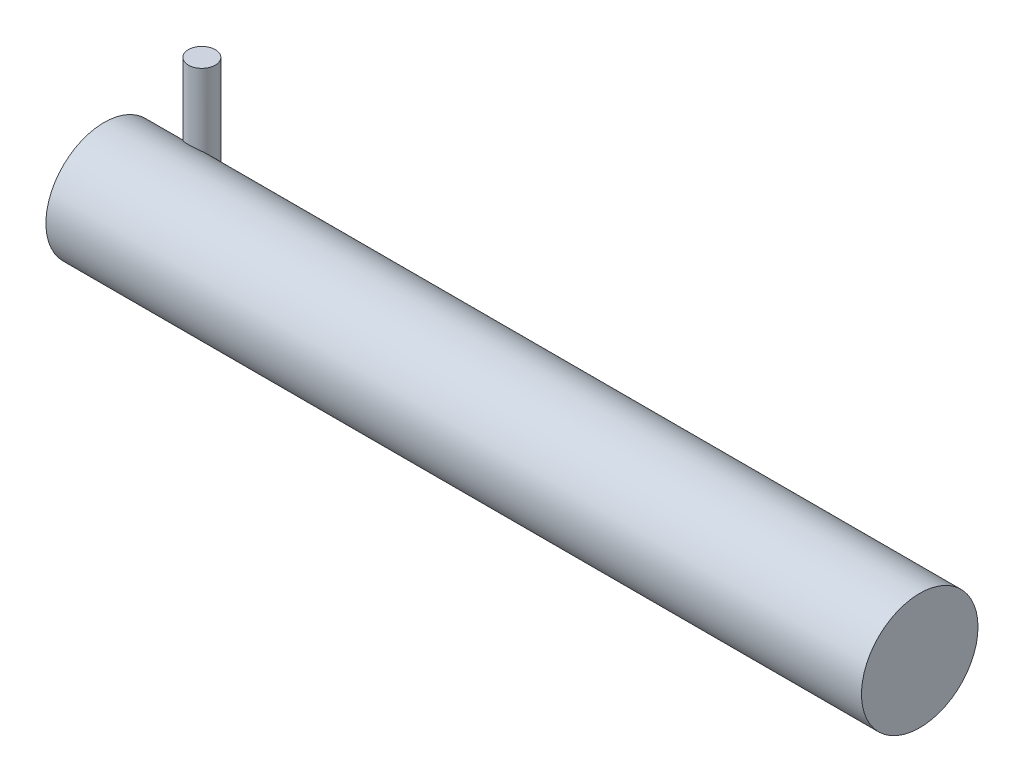
ISO-10303-21;
HEADER;
FILE_DESCRIPTION(('STEP AP214'),'2;1');
FILE_NAME('part.step','',(''),(''),'','','');
FILE_SCHEMA(('AUTOMOTIVE_DESIGN { 1 0 10303 214 1 1 1 1 }'));
ENDSEC;
DATA;
#1=APPLICATION_CONTEXT('core data for automotive mechanical design processes');
#2=APPLICATION_PROTOCOL_DEFINITION('international standard','automotive_design',2000,#1);
#3=PRODUCT_CONTEXT('',#1,'mechanical');
#4=PRODUCT('Part','Part','',(#3));
#5=PRODUCT_RELATED_PRODUCT_CATEGORY('part','',(#4));
#6=PRODUCT_DEFINITION_FORMATION('','',#4);
#7=PRODUCT_DEFINITION_CONTEXT('part definition',#1,'design');
#8=PRODUCT_DEFINITION('design','',#6,#7);
#9=PRODUCT_DEFINITION_SHAPE('','',#8);
#10=(LENGTH_UNIT() NAMED_UNIT(*) SI_UNIT(.MILLI.,.METRE.));
#11=(NAMED_UNIT(*) PLANE_ANGLE_UNIT() SI_UNIT($,.RADIAN.));
#12=(NAMED_UNIT(*) SI_UNIT($,.STERADIAN.) SOLID_ANGLE_UNIT());
#13=UNCERTAINTY_MEASURE_WITH_UNIT(LENGTH_MEASURE(1.E-05),#10,'distance_accuracy_value','');
#14=(GEOMETRIC_REPRESENTATION_CONTEXT(3) GLOBAL_UNCERTAINTY_ASSIGNED_CONTEXT((#13)) GLOBAL_UNIT_ASSIGNED_CONTEXT((#10,
#11,#12)) REPRESENTATION_CONTEXT('',''));
#15=CARTESIAN_POINT('',(0.,0.,0.));
#16=DIRECTION('',(0.,0.,1.));
#17=DIRECTION('',(1.,0.,0.));
#18=AXIS2_PLACEMENT_3D('',#15,#16,#17);
#19=CARTESIAN_POINT('',(70.,0.,0.));
#20=DIRECTION('',(-1.,0.,0.));
#21=DIRECTION('',(0.,0.,1.));
#22=AXIS2_PLACEMENT_3D('',#19,#20,#21);
#23=CYLINDRICAL_SURFACE('',#22,5.);
#24=CARTESIAN_POINT('',(0.,0.,0.));
#25=DIRECTION('',(1.,0.,0.));
#26=DIRECTION('',(0.,0.,-1.));
#27=AXIS2_PLACEMENT_3D('',#24,#25,#26);
#28=CIRCLE('',#27,5.);
#29=CARTESIAN_POINT('',(0.,0.,-5.));
#30=VERTEX_POINT('',#29);
#31=EDGE_CURVE('E69',#30,#30,#28,.T.);
#32=ORIENTED_EDGE('',*,*,#31,.T.);
#33=EDGE_LOOP('',(#32));
#34=FACE_BOUND('',#33,.T.);
#35=CARTESIAN_POINT('',(70.,0.,0.));
#36=DIRECTION('',(1.,0.,0.));
#37=DIRECTION('',(0.,0.,-1.));
#38=AXIS2_PLACEMENT_3D('',#35,#36,#37);
#39=CIRCLE('',#38,5.);
#40=CARTESIAN_POINT('',(70.,0.,-5.));
#41=VERTEX_POINT('',#40);
#42=EDGE_CURVE('E64',#41,#41,#39,.T.);
#43=ORIENTED_EDGE('',*,*,#42,.F.);
#44=EDGE_LOOP('',(#43));
#45=FACE_BOUND('',#44,.T.);
#46=CARTESIAN_POINT('',(3.7403080723953,0.,-5.));
#47=CARTESIAN_POINT('',(3.74031654285205,0.0412414710687475,-5.00000071223977));
#48=CARTESIAN_POINT('',(3.73950383783599,0.0824765192694198,-4.99948965406981));
#49=CARTESIAN_POINT('',(3.73630834279093,0.164847938448094,-4.99745140875703));
#50=CARTESIAN_POINT('',(3.73392605044858,0.205984336557935,-4.99592454370598));
#51=CARTESIAN_POINT('',(3.7245511332552,0.328909386408874,-4.98984306647468));
#52=CARTESIAN_POINT('',(3.71532962729995,0.41046252468489,-4.9837874712133));
#53=CARTESIAN_POINT('',(3.69213595043174,0.572482721014253,-4.96778620573457));
#54=CARTESIAN_POINT('',(3.6781627784587,0.652949546490931,-4.95783971573419));
#55=CARTESIAN_POINT('',(3.64687899798341,0.812725072650039,-4.93416705303572));
#56=CARTESIAN_POINT('',(3.62956534380931,0.892032644854037,-4.92043742614836));
#57=CARTESIAN_POINT('',(3.57866350356115,1.11084778739966,-4.87713392715142));
#58=CARTESIAN_POINT('',(3.54291411676771,1.24906473029694,-4.84355428893073));
#59=CARTESIAN_POINT('',(3.47093924772518,1.52209651691205,-4.76481005371624));
#60=CARTESIAN_POINT('',(3.43471346921181,1.65690907496686,-4.71963788945655));
#61=CARTESIAN_POINT('',(3.36631815198417,1.92277459788118,-4.61769925657684));
#62=CARTESIAN_POINT('',(3.33413855685096,2.05383623225245,-4.56096249009628));
#63=CARTESIAN_POINT('',(3.27789706996648,2.31190193480728,-4.43572191925716));
#64=CARTESIAN_POINT('',(3.25382361327305,2.43891154759426,-4.36723509112497));
#65=CARTESIAN_POINT('',(3.22178043367329,2.66424122207382,-4.23268314470644));
#66=CARTESIAN_POINT('',(3.21162187113142,2.76343235412826,-4.16862411724844));
#67=CARTESIAN_POINT('',(3.20273467599719,2.9575468648251,-4.0332291367525));
#68=CARTESIAN_POINT('',(3.20402006862161,3.05246486334907,-3.96188436044508));
#69=CARTESIAN_POINT('',(3.22203613728855,3.23749459528526,-3.81220143833861));
#70=CARTESIAN_POINT('',(3.23896615658192,3.32752838519286,-3.73378484594354));
#71=CARTESIAN_POINT('',(3.27961887329985,3.45560785519916,-3.61416858062181));
#72=CARTESIAN_POINT('',(3.29568598698955,3.49709617847598,-3.5740110978478));
#73=CARTESIAN_POINT('',(3.33349104776429,3.57735155538919,-3.49367517703475));
#74=CARTESIAN_POINT('',(3.35522442812107,3.61612076870605,-3.45349678175702));
#75=CARTESIAN_POINT('',(3.40940055373551,3.69714677035682,-3.36678267349509));
#76=CARTESIAN_POINT('',(3.44306731346298,3.73877341720701,-3.32040580387941));
#77=CARTESIAN_POINT('',(3.51967772870629,3.81653311065159,-3.23072717217243));
#78=CARTESIAN_POINT('',(3.56261945269806,3.85266729839281,-3.18742477230958));
#79=CARTESIAN_POINT('',(3.65825336589082,3.91869348688536,-3.10590120491951));
#80=CARTESIAN_POINT('',(3.71103335896656,3.94852366172994,-3.0677315901536));
#81=CARTESIAN_POINT('',(3.82513287639818,4.00042725526388,-2.99973734603108));
#82=CARTESIAN_POINT('',(3.88644390714371,4.02250831299154,-2.96990450427329));
#83=CARTESIAN_POINT('',(4.00645799138492,4.05558726543488,-2.92453254770686));
#84=CARTESIAN_POINT('',(4.0643166848589,4.06770662098706,-2.9075738756989));
#85=CARTESIAN_POINT('',(4.18293935962775,4.08526164952594,-2.88285861306663));
#86=CARTESIAN_POINT('',(4.24370131018533,4.09070192522767,-2.87509568556274));
#87=CARTESIAN_POINT('',(4.35912541293167,4.0945259460452,-2.86964503598543));
#88=CARTESIAN_POINT('',(4.41371940124737,4.09362322865634,-2.87093847971395));
#89=CARTESIAN_POINT('',(4.52181661642941,4.08644081352476,-2.88115264236394));
#90=CARTESIAN_POINT('',(4.57532013170977,4.08016255693389,-2.89007131700292));
#91=CARTESIAN_POINT('',(4.6787724963598,4.06253805680623,-2.9147910361215));
#92=CARTESIAN_POINT('',(4.72876814330945,4.05128555619683,-2.93046464835091));
#93=CARTESIAN_POINT('',(4.82504787871821,4.02399216479438,-2.9678308458854));
#94=CARTESIAN_POINT('',(4.8713315687658,4.00795076086935,-2.98952407617624));
#95=CARTESIAN_POINT('',(4.96178235459048,3.9703922862526,-3.03924400204109));
#96=CARTESIAN_POINT('',(5.00568303701581,3.94861750954694,-3.06755879954927));
#97=CARTESIAN_POINT('',(5.08774078884657,3.90060615508984,-3.12838244194173));
#98=CARTESIAN_POINT('',(5.12589480155057,3.87436721850503,-3.16089350190074));
#99=CARTESIAN_POINT('',(5.20963596181251,3.80719809661369,-3.24174829225771));
#100=CARTESIAN_POINT('',(5.25252406456655,3.76447760313087,-3.29140798975219));
#101=CARTESIAN_POINT('',(5.32731068212317,3.67292370699008,-3.39328062293217));
#102=CARTESIAN_POINT('',(5.35919002437355,3.62407983960999,-3.44549783397856));
#103=CARTESIAN_POINT('',(5.42318806389223,3.50210616558362,-3.57007161525293));
#104=CARTESIAN_POINT('',(5.45082603154678,3.42678385491738,-3.6425667531567));
#105=CARTESIAN_POINT('',(5.49065355187769,3.26947385448398,-3.78442004637195));
#106=CARTESIAN_POINT('',(5.50281656381796,3.18747496938816,-3.8537726160668));
#107=CARTESIAN_POINT('',(5.51362901135986,3.03760846855478,-3.97239551026977));
#108=CARTESIAN_POINT('',(5.51469436103192,2.97068748327214,-4.02268556091431));
#109=CARTESIAN_POINT('',(5.51083765971215,2.83450588825681,-4.1197790492775));
#110=CARTESIAN_POINT('',(5.50591216711187,2.76524395593223,-4.16658046645389));
#111=CARTESIAN_POINT('',(5.48388007602387,2.55431748556607,-4.30155004853987));
#112=CARTESIAN_POINT('',(5.45950880984789,2.4097724178444,-4.38407815085416));
#113=CARTESIAN_POINT('',(5.40404090297873,2.13994958350321,-4.52101895880702));
#114=CARTESIAN_POINT('',(5.37473492181068,2.01546171299694,-4.57782480235414));
#115=CARTESIAN_POINT('',(5.31152874938226,1.76314059671843,-4.68080169243696));
#116=CARTESIAN_POINT('',(5.27762384494911,1.63530402894922,-4.72696169586945));
#117=CARTESIAN_POINT('',(5.20910936139353,1.37702470074359,-4.80854435817469));
#118=CARTESIAN_POINT('',(5.17450285714273,1.24659334600532,-4.84400615046191));
#119=CARTESIAN_POINT('',(5.10899325645726,0.982462265047426,-4.90439428988558));
#120=CARTESIAN_POINT('',(5.07808590091496,0.848766515229496,-4.92933283846806));
#121=CARTESIAN_POINT('',(5.04089202476897,0.655084947687727,-4.95724979416126));
#122=CARTESIAN_POINT('',(5.0306096022769,0.596493835775745,-4.96464527880543));
#123=CARTESIAN_POINT('',(5.0124246794085,0.478734837275851,-4.97738083765416));
#124=CARTESIAN_POINT('',(5.00452127405352,0.419567178871124,-4.98272169365539));
#125=CARTESIAN_POINT('',(4.99158738274339,0.300505420752129,-4.99131938681752));
#126=CARTESIAN_POINT('',(4.98656917198965,0.240609308308488,-4.99456732653205));
#127=CARTESIAN_POINT('',(4.97978830283019,0.120482013081676,-4.99891120170353));
#128=CARTESIAN_POINT('',(4.9780297857991,0.060250501436749,-5.00000439971638));
#129=CARTESIAN_POINT('',(4.97807354014361,0.,-5.));
#130=B_SPLINE_CURVE_WITH_KNOTS('',3,(#46,#47,#48,#49,#50,#51,#52,#53,#54,#55,#56,#57,#58,#59,
#60,#61,#62,#63,#64,#65,#66,#67,#68,#69,#70,#71,#72,#73,#74,#75,#76,#77,#78,#79,#80,#81,#82,#83,
#84,#85,#86,#87,#88,#89,#90,#91,#92,#93,#94,#95,#96,#97,#98,#99,#100,#101,#102,#103,#104,#105,
#106,#107,#108,#109,#110,#111,#112,#113,#114,#115,#116,#117,#118,#119,#120,#121,#122,#123,#124,
#125,#126,#127,#128,#129),.UNSPECIFIED.,.F.,.F.,(4,2,2,2,2,2,2,2,2,2,2,2,2,2,2,2,2,2,2,2,2,2,2,
2,2,2,2,2,2,2,2,2,2,2,2,2,2,2,2,2,2,4),(0.,0.123701543249651,0.247363881929549,
0.493945416579861,0.740578932160156,0.98743838670002,1.42683227686883,1.86651372349309,
2.30507982306529,2.74301754738376,3.09786146165932,3.45314031710499,3.81300948497654,
3.99253875591383,4.1719237801084,4.38362863092408,4.59528943634851,4.80893852404911,
5.02237640206187,5.20581916791645,5.38913544784988,5.55218845252817,5.71519775729479,
5.87525796219188,6.03533532373276,6.20443692157148,6.3736281506988,6.60722330457588,
6.84122325349756,7.16383349412958,7.48699629348394,7.73780411044408,7.98875607911249,
8.49164331176004,8.91096057581895,9.33071086751605,9.74890658229283,10.1666160679639,
10.3463818738766,10.5260792101666,10.7065355254053,10.8872209500027),.UNSPECIFIED.);
#131=CARTESIAN_POINT('',(3.7403080723953,0.,-5.));
#132=VERTEX_POINT('',#131);
#133=CARTESIAN_POINT('',(4.97807354014361,0.,-5.));
#134=VERTEX_POINT('',#133);
#135=EDGE_CURVE('E11',#132,#134,#130,.T.);
#136=ORIENTED_EDGE('',*,*,#135,.F.);
#137=DIRECTION('',(-1.,0.,0.));
#138=VECTOR('',#137,1.);
#139=CARTESIAN_POINT('',(70.,0.,-5.));
#140=LINE('',#139,#138);
#141=EDGE_CURVE('E52',#134,#132,#140,.T.);
#142=ORIENTED_EDGE('',*,*,#141,.F.);
#143=EDGE_LOOP('',(#136,#142));
#144=FACE_BOUND('',#143,.T.);
#145=ADVANCED_FACE('F39',(#34,#45,#144),#23,.T.);
#146=CARTESIAN_POINT('',(70.,0.,0.));
#147=DIRECTION('',(1.,0.,0.));
#148=DIRECTION('',(0.,0.,-1.));
#149=AXIS2_PLACEMENT_3D('',#146,#147,#148);
#150=PLANE('',#149);
#151=ORIENTED_EDGE('',*,*,#42,.T.);
#152=EDGE_LOOP('',(#151));
#153=FACE_BOUND('',#152,.T.);
#154=ADVANCED_FACE('F81',(#153),#150,.T.);
#155=CARTESIAN_POINT('',(0.,0.,0.));
#156=DIRECTION('',(1.,0.,0.));
#157=DIRECTION('',(0.,0.,-1.));
#158=AXIS2_PLACEMENT_3D('',#155,#156,#157);
#159=PLANE('',#158);
#160=ORIENTED_EDGE('',*,*,#31,.F.);
#161=EDGE_LOOP('',(#160));
#162=FACE_BOUND('',#161,.T.);
#163=ADVANCED_FACE('F79',(#162),#159,.F.);
#164=CARTESIAN_POINT('',(4.35919080626945,10.,-4.02541326849359));
#165=DIRECTION('',(0.,-1.,0.));
#166=DIRECTION('',(0.,0.,-1.));
#167=AXIS2_PLACEMENT_3D('',#164,#165,#166);
#168=CYLINDRICAL_SURFACE('',#167,1.15448479224106);
#169=CARTESIAN_POINT('',(4.35919080626945,10.,-4.02541326849359));
#170=DIRECTION('',(0.,1.,0.));
#171=DIRECTION('',(0.,0.,1.));
#172=AXIS2_PLACEMENT_3D('',#169,#170,#171);
#173=CIRCLE('',#172,1.15448479224106);
#174=CARTESIAN_POINT('',(4.35919080626945,10.,-2.87092847625253));
#175=VERTEX_POINT('',#174);
#176=EDGE_CURVE('E66',#175,#175,#173,.T.);
#177=ORIENTED_EDGE('',*,*,#176,.F.);
#178=EDGE_LOOP('',(#177));
#179=FACE_BOUND('',#178,.T.);
#180=CARTESIAN_POINT('',(4.35919080626945,0.,-4.02541326849359));
#181=DIRECTION('',(0.,1.,0.));
#182=DIRECTION('',(0.,0.,1.));
#183=AXIS2_PLACEMENT_3D('',#180,#181,#182);
#184=CIRCLE('',#183,1.15448479224106);
#185=EDGE_CURVE('E63',#134,#132,#184,.T.);
#186=ORIENTED_EDGE('',*,*,#185,.T.);
#187=ORIENTED_EDGE('',*,*,#135,.T.);
#188=EDGE_LOOP('',(#186,#187));
#189=FACE_BOUND('',#188,.T.);
#190=ADVANCED_FACE('F65',(#179,#189),#168,.T.);
#191=CARTESIAN_POINT('',(4.35919080626945,0.,-4.02541326849359));
#192=DIRECTION('',(0.,1.,0.));
#193=DIRECTION('',(0.,0.,1.));
#194=AXIS2_PLACEMENT_3D('',#191,#192,#193);
#195=PLANE('',#194);
#196=ORIENTED_EDGE('',*,*,#185,.F.);
#197=ORIENTED_EDGE('',*,*,#141,.T.);
#198=EDGE_LOOP('',(#196,#197));
#199=FACE_BOUND('',#198,.T.);
#200=ADVANCED_FACE('F62',(#199),#195,.F.);
#201=CARTESIAN_POINT('',(4.35919080626945,10.,-4.02541326849359));
#202=DIRECTION('',(0.,1.,0.));
#203=DIRECTION('',(0.,0.,1.));
#204=AXIS2_PLACEMENT_3D('',#201,#202,#203);
#205=PLANE('',#204);
#206=ORIENTED_EDGE('',*,*,#176,.T.);
#207=EDGE_LOOP('',(#206));
#208=FACE_BOUND('',#207,.T.);
#209=ADVANCED_FACE('F104',(#208),#205,.T.);
#210=CLOSED_SHELL('',(#145,#154,#163,#190,#200,#209));
#211=MANIFOLD_SOLID_BREP('B2',#210);
#212=ADVANCED_BREP_SHAPE_REPRESENTATION('',(#18,#211),#14);
#213=SHAPE_DEFINITION_REPRESENTATION(#9,#212);
ENDSEC;
END-ISO-10303-21;
